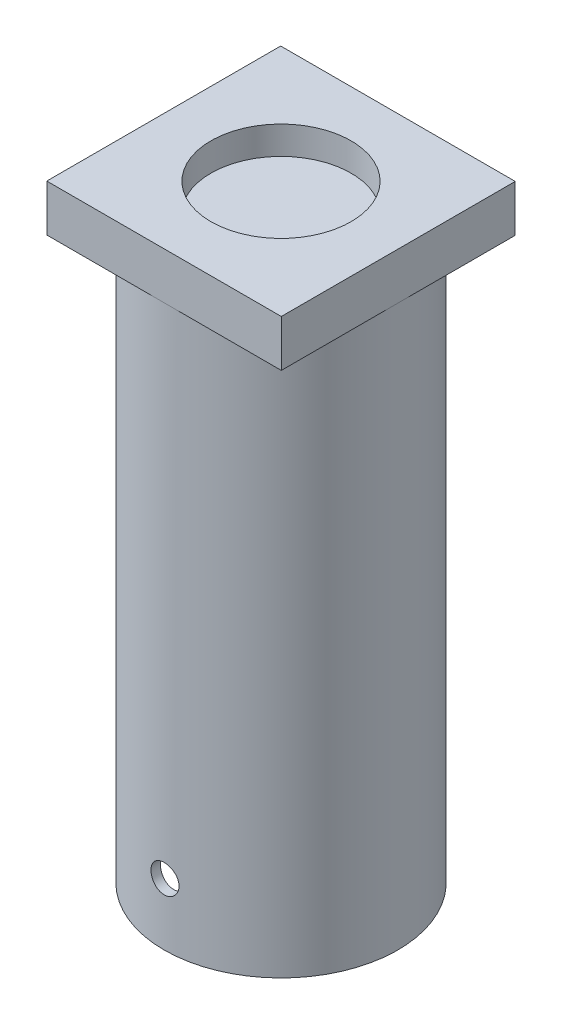
ISO-10303-21;
HEADER;
FILE_DESCRIPTION(('STEP AP214'),'2;1');
FILE_NAME('part.step','',(''),(''),'','','');
FILE_SCHEMA(('AUTOMOTIVE_DESIGN { 1 0 10303 214 1 1 1 1 }'));
ENDSEC;
DATA;
#1=APPLICATION_CONTEXT('core data for automotive mechanical design processes');
#2=APPLICATION_PROTOCOL_DEFINITION('international standard','automotive_design',2000,#1);
#3=PRODUCT_CONTEXT('',#1,'mechanical');
#4=PRODUCT('Part','Part','',(#3));
#5=PRODUCT_RELATED_PRODUCT_CATEGORY('part','',(#4));
#6=PRODUCT_DEFINITION_FORMATION('','',#4);
#7=PRODUCT_DEFINITION_CONTEXT('part definition',#1,'design');
#8=PRODUCT_DEFINITION('design','',#6,#7);
#9=PRODUCT_DEFINITION_SHAPE('','',#8);
#10=(LENGTH_UNIT() NAMED_UNIT(*) SI_UNIT(.MILLI.,.METRE.));
#11=(NAMED_UNIT(*) PLANE_ANGLE_UNIT() SI_UNIT($,.RADIAN.));
#12=(NAMED_UNIT(*) SI_UNIT($,.STERADIAN.) SOLID_ANGLE_UNIT());
#13=UNCERTAINTY_MEASURE_WITH_UNIT(LENGTH_MEASURE(1.E-05),#10,'distance_accuracy_value','');
#14=(GEOMETRIC_REPRESENTATION_CONTEXT(3) GLOBAL_UNCERTAINTY_ASSIGNED_CONTEXT((#13)) GLOBAL_UNIT_ASSIGNED_CONTEXT((#10,
#11,#12)) REPRESENTATION_CONTEXT('',''));
#15=CARTESIAN_POINT('',(0.,0.,0.));
#16=DIRECTION('',(0.,0.,1.));
#17=DIRECTION('',(1.,0.,0.));
#18=AXIS2_PLACEMENT_3D('',#15,#16,#17);
#19=CARTESIAN_POINT('',(0.,60.,0.));
#20=DIRECTION('',(0.,-1.,0.));
#21=DIRECTION('',(0.,0.,-1.));
#22=AXIS2_PLACEMENT_3D('',#19,#20,#21);
#23=CYLINDRICAL_SURFACE('',#22,12.5);
#24=CARTESIAN_POINT('',(0.,60.,0.));
#25=DIRECTION('',(0.,1.,0.));
#26=DIRECTION('',(0.,0.,1.));
#27=AXIS2_PLACEMENT_3D('',#24,#25,#26);
#28=CIRCLE('',#27,12.5);
#29=CARTESIAN_POINT('',(0.,60.,12.5));
#30=VERTEX_POINT('',#29);
#31=EDGE_CURVE('E11',#30,#30,#28,.T.);
#32=ORIENTED_EDGE('',*,*,#31,.F.);
#33=EDGE_LOOP('',(#32));
#34=FACE_BOUND('',#33,.T.);
#35=CARTESIAN_POINT('',(0.,0.,0.));
#36=DIRECTION('',(0.,1.,0.));
#37=DIRECTION('',(0.,0.,1.));
#38=AXIS2_PLACEMENT_3D('',#35,#36,#37);
#39=CIRCLE('',#38,12.5);
#40=CARTESIAN_POINT('',(0.,0.,12.5));
#41=VERTEX_POINT('',#40);
#42=EDGE_CURVE('E54',#41,#41,#39,.T.);
#43=ORIENTED_EDGE('',*,*,#42,.T.);
#44=EDGE_LOOP('',(#43));
#45=FACE_BOUND('',#44,.T.);
#46=CARTESIAN_POINT('',(-1.5,6.62,12.4096736459909));
#47=CARTESIAN_POINT('',(-1.49999641586388,6.70392957059518,12.4096748089167));
#48=CARTESIAN_POINT('',(-1.49293206748169,6.7879122600607,12.4105342894214));
#49=CARTESIAN_POINT('',(-1.46486159354819,6.95354230601578,12.4138782255216));
#50=CARTESIAN_POINT('',(-1.44384072619508,7.03518709784051,12.4163643992983));
#51=CARTESIAN_POINT('',(-1.38848417307918,7.19371920275691,12.4226761552619));
#52=CARTESIAN_POINT('',(-1.35415731394874,7.27060963056811,12.426500849368));
#53=CARTESIAN_POINT('',(-1.27318168778971,7.41752357105049,12.4350576249844));
#54=CARTESIAN_POINT('',(-1.22653510106007,7.48754829578398,12.4397895458966));
#55=CARTESIAN_POINT('',(-1.12198571965019,7.61911988580509,12.4496550027324));
#56=CARTESIAN_POINT('',(-1.06403198625323,7.6806261471743,12.4547902908254));
#57=CARTESIAN_POINT('',(-0.938622932174394,7.79306435908096,12.4648680792729));
#58=CARTESIAN_POINT('',(-0.871167147527067,7.8439957929709,12.4698105701984));
#59=CARTESIAN_POINT('',(-0.728414784233987,7.93398326646814,12.4789637011531));
#60=CARTESIAN_POINT('',(-0.653094976924493,7.97300270786982,12.4831720690333));
#61=CARTESIAN_POINT('',(-0.496912883636387,8.03782423019237,12.4903635621621));
#62=CARTESIAN_POINT('',(-0.41605078804277,8.06362676487387,12.4933467294733));
#63=CARTESIAN_POINT('',(-0.251493928492541,8.10116112805173,12.4977393662263));
#64=CARTESIAN_POINT('',(-0.167814735521689,8.11296032672289,12.4991563682204));
#65=CARTESIAN_POINT('',(0.000347248334283274,8.12236179965526,12.5002827183051));
#66=CARTESIAN_POINT('',(0.0848300098341703,8.11996459107911,12.4999921286017));
#67=CARTESIAN_POINT('',(0.251742833758765,8.10109543907432,12.4977421462633));
#68=CARTESIAN_POINT('',(0.334181218784107,8.08469594751381,12.4957913442169));
#69=CARTESIAN_POINT('',(0.495127185045589,8.038400924142,12.490449821119));
#70=CARTESIAN_POINT('',(0.573634696521302,8.00850515290918,12.4870590745233));
#71=CARTESIAN_POINT('',(0.724715561629688,7.93598863554674,12.4792038952277));
#72=CARTESIAN_POINT('',(0.797273648637692,7.89333638199679,12.4747368094346));
#73=CARTESIAN_POINT('',(0.934229460099392,7.79654055052193,12.465229048358));
#74=CARTESIAN_POINT('',(0.998626839383445,7.7423964867922,12.4601883488298));
#75=CARTESIAN_POINT('',(1.11785860561525,7.62374782522977,12.4500603372648));
#76=CARTESIAN_POINT('',(1.17263019439189,7.55918010931325,12.4449729316271));
#77=CARTESIAN_POINT('',(1.27056795912578,7.42173424316025,12.4353563023037));
#78=CARTESIAN_POINT('',(1.31373410365263,7.34885607041776,12.4308270801297));
#79=CARTESIAN_POINT('',(1.38723839179325,7.19680375492631,12.4228396027608));
#80=CARTESIAN_POINT('',(1.41757175578821,7.11762727937105,12.4193817467283));
#81=CARTESIAN_POINT('',(1.46449505016189,6.95525382024941,12.4139364153306));
#82=CARTESIAN_POINT('',(1.48108558929276,6.87205701494035,12.4119488748366));
#83=CARTESIAN_POINT('',(1.49996964356083,6.70455845181166,12.4096810007818));
#84=CARTESIAN_POINT('',(1.50235142135386,6.62026678205943,12.4093901280317));
#85=CARTESIAN_POINT('',(1.49298299027801,6.45248560957853,12.4105206650573));
#86=CARTESIAN_POINT('',(1.48123305845624,6.36899609115631,12.411942041265));
#87=CARTESIAN_POINT('',(1.44400895971009,6.20545210820101,12.4163273137489));
#88=CARTESIAN_POINT('',(1.41857731249469,6.12538782659534,12.4192864301079));
#89=CARTESIAN_POINT('',(1.35475538396312,5.97066035851202,12.4264098926624));
#90=CARTESIAN_POINT('',(1.31636468129306,5.89599734774848,12.4305742780457));
#91=CARTESIAN_POINT('',(1.22749651360805,5.75379185251269,12.4396643656649));
#92=CARTESIAN_POINT('',(1.17696103570738,5.68628585655935,12.4445936804928));
#93=CARTESIAN_POINT('',(1.06532008918354,5.56068244349411,12.4546467770184));
#94=CARTESIAN_POINT('',(1.0042142422181,5.50258536329706,12.4597705656719));
#95=CARTESIAN_POINT('',(0.872782136333861,5.39714012638254,12.4696675472455));
#96=CARTESIAN_POINT('',(0.802409249708917,5.34984987674429,12.4744387628015));
#97=CARTESIAN_POINT('',(0.65466821470529,5.26776089533545,12.483063621558));
#98=CARTESIAN_POINT('',(0.577300197822208,5.23296192881278,12.4869172820019));
#99=CARTESIAN_POINT('',(0.417959622359993,5.1769394975621,12.4932640215257));
#100=CARTESIAN_POINT('',(0.335999085323591,5.15568224005788,12.4957604851314));
#101=CARTESIAN_POINT('',(0.169640292495739,5.12723662820892,12.4991255682254));
#102=CARTESIAN_POINT('',(0.085242137730631,5.12004769165343,12.4999942550783));
#103=CARTESIAN_POINT('',(-0.0830300031278292,5.11995307794384,12.5000056524324));
#104=CARTESIAN_POINT('',(-0.166903952329435,5.12695798165839,12.4991591682624));
#105=CARTESIAN_POINT('',(-0.332273612398117,5.15486322745124,12.4958567701035));
#106=CARTESIAN_POINT('',(-0.413769324044743,5.17576356497476,12.4934008566421));
#107=CARTESIAN_POINT('',(-0.572059777991807,5.23083900756579,12.4871544009745));
#108=CARTESIAN_POINT('',(-0.648855904373999,5.26501018222725,12.4833642539575));
#109=CARTESIAN_POINT('',(-0.795637705262655,5.3456480347922,12.474869622158));
#110=CARTESIAN_POINT('',(-0.865623324646851,5.39211481220143,12.4701651299761));
#111=CARTESIAN_POINT('',(-0.997254742124291,5.49635684100313,12.4603319681132));
#112=CARTESIAN_POINT('',(-1.0588476339384,5.55419867766288,12.4552009088046));
#113=CARTESIAN_POINT('',(-1.17148865356204,5.67941151857622,12.4451123432295));
#114=CARTESIAN_POINT('',(-1.22253427406543,5.74678478225066,12.4401548784622));
#115=CARTESIAN_POINT('',(-1.31278537364373,5.88942146808525,12.4309559603764));
#116=CARTESIAN_POINT('',(-1.35194799100155,5.96471216413648,12.4267171228205));
#117=CARTESIAN_POINT('',(-1.41701902911872,6.12080887687539,12.419466118837));
#118=CARTESIAN_POINT('',(-1.44294198213015,6.20160873559888,12.4164526081981));
#119=CARTESIAN_POINT('',(-1.4745350503682,6.33902976955269,12.4127313618494));
#120=CARTESIAN_POINT('',(-1.48407082470974,6.39478137597994,12.4115903654975));
#121=CARTESIAN_POINT('',(-1.49680448454756,6.50701396606712,12.4100611186528));
#122=CARTESIAN_POINT('',(-1.50000241299709,6.5634949447813,12.4096728630583));
#123=CARTESIAN_POINT('',(-1.5,6.62,12.4096736459909));
#124=B_SPLINE_CURVE_WITH_KNOTS('',3,(#46,#47,#48,#49,#50,#51,#52,#53,#54,#55,#56,#57,#58,#59,
#60,#61,#62,#63,#64,#65,#66,#67,#68,#69,#70,#71,#72,#73,#74,#75,#76,#77,#78,#79,#80,#81,#82,#83,
#84,#85,#86,#87,#88,#89,#90,#91,#92,#93,#94,#95,#96,#97,#98,#99,#100,#101,#102,#103,#104,#105,
#106,#107,#108,#109,#110,#111,#112,#113,#114,#115,#116,#117,#118,#119,#120,#121,#122,#123),
.UNSPECIFIED.,.T.,.F.,(4,2,2,2,2,2,2,2,2,2,2,2,2,2,2,2,2,2,2,2,2,2,2,2,2,2,2,2,2,2,2,2,2,2,2,2,
2,2,4),(0.,0.251582306609609,0.503430774819312,0.755112462522263,1.0067496383611,
1.25954776660377,1.51235824273611,1.7659378087677,2.01950866836447,2.27185458608052,
2.52419131111312,2.77523023079344,3.02627360403335,3.27794222677635,3.52962149067918,
3.78288622204422,4.03615163930559,4.28951130338294,4.54285974404081,4.79463277043148,
5.0464008609825,5.29739099483104,5.54838929022027,5.80061125155309,6.05284224246468,
6.30639464647639,6.55994228515918,6.81285470170487,7.06575665136928,7.31707030939076,
7.56838388503437,7.81962308616498,8.07086432058376,8.32362252061905,8.57644073759112,
8.83016031080822,9.08360079205963,9.25297814464872,9.42235434931908),.UNSPECIFIED.);
#125=CARTESIAN_POINT('',(-1.5,6.62,12.4096736459909));
#126=VERTEX_POINT('',#125);
#127=EDGE_CURVE('E136',#126,#126,#124,.T.);
#128=ORIENTED_EDGE('',*,*,#127,.T.);
#129=EDGE_LOOP('',(#128));
#130=FACE_BOUND('',#129,.T.);
#131=ADVANCED_FACE('F39',(#34,#45,#130),#23,.T.);
#132=CARTESIAN_POINT('',(0.,60.,0.));
#133=DIRECTION('',(0.,-1.,0.));
#134=DIRECTION('',(0.,0.,-1.));
#135=AXIS2_PLACEMENT_3D('',#132,#133,#134);
#136=CYLINDRICAL_SURFACE('',#135,11.5);
#137=CARTESIAN_POINT('',(0.,0.,0.));
#138=DIRECTION('',(0.,1.,0.));
#139=DIRECTION('',(0.,0.,1.));
#140=AXIS2_PLACEMENT_3D('',#137,#138,#139);
#141=CIRCLE('',#140,11.5);
#142=CARTESIAN_POINT('',(0.,0.,11.5));
#143=VERTEX_POINT('',#142);
#144=EDGE_CURVE('E174',#143,#143,#141,.T.);
#145=ORIENTED_EDGE('',*,*,#144,.F.);
#146=EDGE_LOOP('',(#145));
#147=FACE_BOUND('',#146,.T.);
#148=CARTESIAN_POINT('',(0.,60.,0.));
#149=DIRECTION('',(0.,1.,0.));
#150=DIRECTION('',(0.,0.,1.));
#151=AXIS2_PLACEMENT_3D('',#148,#149,#150);
#152=CIRCLE('',#151,11.5);
#153=CARTESIAN_POINT('',(0.,60.,11.5));
#154=VERTEX_POINT('',#153);
#155=EDGE_CURVE('E135',#154,#154,#152,.T.);
#156=ORIENTED_EDGE('',*,*,#155,.T.);
#157=EDGE_LOOP('',(#156));
#158=FACE_BOUND('',#157,.T.);
#159=CARTESIAN_POINT('',(-1.5,6.62,11.4017542509914));
#160=CARTESIAN_POINT('',(-1.49999645301449,6.53612974605351,11.4017555010927));
#161=CARTESIAN_POINT('',(-1.49294203416221,6.45220782531927,11.4026896606142));
#162=CARTESIAN_POINT('',(-1.46491333453698,6.28670172381516,11.4063237260242));
#163=CARTESIAN_POINT('',(-1.44392470388228,6.2051200435448,11.4090254521656));
#164=CARTESIAN_POINT('',(-1.3886587589991,6.04671451862599,11.4158835494573));
#165=CARTESIAN_POINT('',(-1.3543907018073,5.96988740275981,11.4200389070908));
#166=CARTESIAN_POINT('',(-1.27355889313978,5.82308774393182,11.4293348464697));
#167=CARTESIAN_POINT('',(-1.22699716043964,5.75311407813169,11.4344752664174));
#168=CARTESIAN_POINT('',(-1.12259656958886,5.62156838698374,11.445197137233));
#169=CARTESIAN_POINT('',(-1.06469780379541,5.56004408459846,11.450780832969));
#170=CARTESIAN_POINT('',(-0.939395748791591,5.44755607833825,11.4617399588797));
#171=CARTESIAN_POINT('',(-0.871991977267099,5.39659291069305,11.4671153784682));
#172=CARTESIAN_POINT('',(-0.729292001348481,5.30650155148103,11.4770753814867));
#173=CARTESIAN_POINT('',(-0.653968201092621,5.26741671965129,11.4816570418954));
#174=CARTESIAN_POINT('',(-0.497756037054306,5.20246933335581,11.4894885821545));
#175=CARTESIAN_POINT('',(-0.41686789753894,5.17660624635005,11.4927385156426));
#176=CARTESIAN_POINT('',(-0.252312093764224,5.1389795606891,11.4975246059022));
#177=CARTESIAN_POINT('',(-0.168662889559622,5.12713647735637,11.4990704204953));
#178=CARTESIAN_POINT('',(-0.000551051593619637,5.11763955068957,11.5003071067839));
#179=CARTESIAN_POINT('',(0.0839115473356039,5.11998510242648,11.4999980575609));
#180=CARTESIAN_POINT('',(0.250711499958836,5.13873536177968,11.4975676318304));
#181=CARTESIAN_POINT('',(0.333058646852885,5.15505458012217,11.495457275758));
#182=CARTESIAN_POINT('',(0.493835455554849,5.2011551807269,11.4896737037343));
#183=CARTESIAN_POINT('',(0.572265037316047,5.23093683793923,11.4860004558634));
#184=CARTESIAN_POINT('',(0.723243851165393,5.30320714577404,11.4774848372199));
#185=CARTESIAN_POINT('',(0.795775273641202,5.34573258809549,11.4726390893116));
#186=CARTESIAN_POINT('',(0.932704606534634,5.44225654245437,11.4623201935655));
#187=CARTESIAN_POINT('',(0.997102110698518,5.49625562718919,11.4568470144162));
#188=CARTESIAN_POINT('',(1.11643819513605,5.61467233134334,11.4458372756446));
#189=CARTESIAN_POINT('',(1.17130282662102,5.6791644846265,11.4403005474487));
#190=CARTESIAN_POINT('',(1.2694404810369,5.8164811631493,11.4298278324284));
#191=CARTESIAN_POINT('',(1.31271346156177,5.88930571887019,11.4248918478017));
#192=CARTESIAN_POINT('',(1.38644483776161,6.04128812702736,11.4161795912173));
#193=CARTESIAN_POINT('',(1.41689697165318,6.12044905177646,11.4124038861902));
#194=CARTESIAN_POINT('',(1.46405488015557,6.28282134575287,11.4064505206358));
#195=CARTESIAN_POINT('',(1.48076137834162,6.36603250153029,11.4042727759921));
#196=CARTESIAN_POINT('',(1.49985514370483,6.53348911375159,11.4017774109739));
#197=CARTESIAN_POINT('',(1.50234663257981,6.61772249239381,11.4014462521966));
#198=CARTESIAN_POINT('',(1.49321496203163,6.78540547241167,11.4026457215703));
#199=CARTESIAN_POINT('',(1.48159213091645,6.86885509197255,11.4041763064158));
#200=CARTESIAN_POINT('',(1.44464963434861,7.03228727005644,11.4089144348313));
#201=CARTESIAN_POINT('',(1.41938072914779,7.11228149832657,11.4121157621508));
#202=CARTESIAN_POINT('',(1.35591573806608,7.26689781992073,11.4198296111094));
#203=CARTESIAN_POINT('',(1.31771916001082,7.34151970858118,11.4243421826685));
#204=CARTESIAN_POINT('',(1.22922802110626,7.48374376689709,11.4342023912125));
#205=CARTESIAN_POINT('',(1.17886529183312,7.5513031952319,11.4395546717524));
#206=CARTESIAN_POINT('',(1.06756750174708,7.67704780596861,11.4504767766229));
#207=CARTESIAN_POINT('',(1.00663199235394,7.73523259042251,11.4560466101759));
#208=CARTESIAN_POINT('',(0.875462338341591,7.84094402888092,11.4668179794224));
#209=CARTESIAN_POINT('',(0.805172669271243,7.88840207901289,11.4720170065382));
#210=CARTESIAN_POINT('',(0.657558967858981,7.97083753540957,11.4814231748458));
#211=CARTESIAN_POINT('',(0.580235088015153,8.00581521216149,11.4856303375335));
#212=CARTESIAN_POINT('',(0.420973071168351,8.06218448448026,11.4925676402684));
#213=CARTESIAN_POINT('',(0.339049006517432,8.08361529312715,11.4953020399787));
#214=CARTESIAN_POINT('',(0.172727196515984,8.11240992971607,11.4990034533124));
#215=CARTESIAN_POINT('',(0.0883295733447041,8.119774451265,11.4999705540811));
#216=CARTESIAN_POINT('',(-0.0798746769516796,8.12021369871507,11.5000279000696));
#217=CARTESIAN_POINT('',(-0.163681043071284,8.11339404014946,11.4991320170928));
#218=CARTESIAN_POINT('',(-0.328945491538641,8.08588274606021,11.4955917059201));
#219=CARTESIAN_POINT('',(-0.41040357656716,8.06519112637328,11.4929472797203));
#220=CARTESIAN_POINT('',(-0.568642219855317,8.01055733378628,11.4862056490748));
#221=CARTESIAN_POINT('',(-0.645424712431708,7.97662068407239,11.4821090502512));
#222=CARTESIAN_POINT('',(-0.792221787328596,7.89647113767378,11.4729159452671));
#223=CARTESIAN_POINT('',(-0.862236260369662,7.85025804281329,11.4678194229654));
#224=CARTESIAN_POINT('',(-0.994048728546038,7.74647834381003,11.4571496362498));
#225=CARTESIAN_POINT('',(-1.05578467493496,7.6888332476528,11.4515732358814));
#226=CARTESIAN_POINT('',(-1.16874758745896,7.56398969875131,11.4405969587125));
#227=CARTESIAN_POINT('',(-1.2199720669361,7.49678899182308,11.4351971239349));
#228=CARTESIAN_POINT('',(-1.31064441090517,7.35441564651668,11.425161148306));
#229=CARTESIAN_POINT('',(-1.35004186374931,7.27921068337355,11.4205283132887));
#230=CARTESIAN_POINT('',(-1.41559127347487,7.12323216464592,11.4125895944072));
#231=CARTESIAN_POINT('',(-1.44175750369104,7.04246471702342,11.4092822814234));
#232=CARTESIAN_POINT('',(-1.47390259785781,6.90440820135864,11.4051643222105));
#233=CARTESIAN_POINT('',(-1.48367487173576,6.84798658642477,11.4038919959272));
#234=CARTESIAN_POINT('',(-1.49672475464482,6.73438465517099,11.4021865375875));
#235=CARTESIAN_POINT('',(-1.50000241924847,6.67720434534723,11.4017533983503));
#236=CARTESIAN_POINT('',(-1.5,6.62,11.4017542509914));
#237=B_SPLINE_CURVE_WITH_KNOTS('',3,(#159,#160,#161,#162,#163,#164,#165,#166,#167,#168,#169,
#170,#171,#172,#173,#174,#175,#176,#177,#178,#179,#180,#181,#182,#183,#184,#185,#186,#187,#188,
#189,#190,#191,#192,#193,#194,#195,#196,#197,#198,#199,#200,#201,#202,#203,#204,#205,#206,#207,
#208,#209,#210,#211,#212,#213,#214,#215,#216,#217,#218,#219,#220,#221,#222,#223,#224,#225,#226,
#227,#228,#229,#230,#231,#232,#233,#234,#235,#236),.UNSPECIFIED.,.T.,.F.,(4,2,2,2,2,2,2,2,2,2,2,
2,2,2,2,2,2,2,2,2,2,2,2,2,2,2,2,2,2,2,2,2,2,2,2,2,2,2,4),(0.,0.251401763409771,
0.503062830563612,0.754548780434044,1.00599345881713,1.25880454908432,1.51162847240694,
1.76536449581033,2.01909029853277,2.27137063822619,2.52364022208436,2.77437738752206,
3.0251196741212,3.27659295200133,3.52807878491241,3.78143590806991,4.03479395807764,
4.28827560662902,4.54174391096107,4.79335142269097,5.04495308198347,5.29562522352575,
5.54630690957677,5.79842717499934,6.05055813995758,6.30425867142356,6.55795370410217,
6.8109109813241,7.06385578493151,7.31492390374275,7.56599173592654,7.81695498432957,
8.06792228421936,8.32067641903952,8.57349027819168,8.82736691371986,9.08096908946926,
9.25244104378408,9.42391153085533),.UNSPECIFIED.);
#238=CARTESIAN_POINT('',(-1.5,6.62,11.4017542509914));
#239=VERTEX_POINT('',#238);
#240=EDGE_CURVE('E42',#239,#239,#237,.T.);
#241=ORIENTED_EDGE('',*,*,#240,.T.);
#242=EDGE_LOOP('',(#241));
#243=FACE_BOUND('',#242,.T.);
#244=ADVANCED_FACE('F149',(#147,#158,#243),#136,.F.);
#245=CARTESIAN_POINT('',(0.,0.,0.));
#246=DIRECTION('',(0.,1.,0.));
#247=DIRECTION('',(0.,0.,1.));
#248=AXIS2_PLACEMENT_3D('',#245,#246,#247);
#249=PLANE('',#248);
#250=ORIENTED_EDGE('',*,*,#42,.F.);
#251=EDGE_LOOP('',(#250));
#252=FACE_BOUND('',#251,.T.);
#253=ORIENTED_EDGE('',*,*,#144,.T.);
#254=EDGE_LOOP('',(#253));
#255=FACE_BOUND('',#254,.T.);
#256=ADVANCED_FACE('F152',(#252,#255),#249,.F.);
#257=CARTESIAN_POINT('',(0.,6.62,12.501));
#258=DIRECTION('',(0.,0.,-1.));
#259=DIRECTION('',(-1.,0.,0.));
#260=AXIS2_PLACEMENT_3D('',#257,#258,#259);
#261=CYLINDRICAL_SURFACE('',#260,1.5);
#262=ORIENTED_EDGE('',*,*,#240,.F.);
#263=EDGE_LOOP('',(#262));
#264=FACE_BOUND('',#263,.T.);
#265=ORIENTED_EDGE('',*,*,#127,.F.);
#266=EDGE_LOOP('',(#265));
#267=FACE_BOUND('',#266,.T.);
#268=ADVANCED_FACE('F145',(#264,#267),#261,.F.);
#269=CARTESIAN_POINT('',(0.,60.,0.));
#270=DIRECTION('',(0.,1.,0.));
#271=DIRECTION('',(0.,0.,1.));
#272=AXIS2_PLACEMENT_3D('',#269,#270,#271);
#273=PLANE('',#272);
#274=ORIENTED_EDGE('',*,*,#155,.F.);
#275=EDGE_LOOP('',(#274));
#276=FACE_BOUND('',#275,.T.);
#277=ADVANCED_FACE('F159',(#276),#273,.F.);
#278=CARTESIAN_POINT('',(12.548712851795,65.,-12.5154478057969));
#279=DIRECTION('',(-1.,0.,0.));
#280=DIRECTION('',(0.,0.,1.));
#281=AXIS2_PLACEMENT_3D('',#278,#279,#280);
#282=PLANE('',#281);
#283=DIRECTION('',(0.,0.,-1.));
#284=VECTOR('',#283,1.);
#285=CARTESIAN_POINT('',(12.548712851795,60.,-12.5154478057969));
#286=LINE('',#285,#284);
#287=CARTESIAN_POINT('',(12.548712851795,60.,12.5154478057969));
#288=VERTEX_POINT('',#287);
#289=CARTESIAN_POINT('',(12.548712851795,60.,-12.5154478057969));
#290=VERTEX_POINT('',#289);
#291=EDGE_CURVE('E118',#288,#290,#286,.T.);
#292=ORIENTED_EDGE('',*,*,#291,.T.);
#293=DIRECTION('',(0.,-1.,0.));
#294=VECTOR('',#293,1.);
#295=CARTESIAN_POINT('',(12.548712851795,65.,-12.5154478057969));
#296=LINE('',#295,#294);
#297=CARTESIAN_POINT('',(12.548712851795,65.,-12.5154478057969));
#298=VERTEX_POINT('',#297);
#299=EDGE_CURVE('E107',#298,#290,#296,.T.);
#300=ORIENTED_EDGE('',*,*,#299,.F.);
#301=DIRECTION('',(0.,0.,-1.));
#302=VECTOR('',#301,1.);
#303=CARTESIAN_POINT('',(12.548712851795,65.,-12.5154478057969));
#304=LINE('',#303,#302);
#305=CARTESIAN_POINT('',(12.548712851795,65.,12.5154478057969));
#306=VERTEX_POINT('',#305);
#307=EDGE_CURVE('E99',#306,#298,#304,.T.);
#308=ORIENTED_EDGE('',*,*,#307,.F.);
#309=DIRECTION('',(0.,-1.,0.));
#310=VECTOR('',#309,1.);
#311=CARTESIAN_POINT('',(12.548712851795,65.,12.5154478057969));
#312=LINE('',#311,#310);
#313=EDGE_CURVE('E114',#306,#288,#312,.T.);
#314=ORIENTED_EDGE('',*,*,#313,.T.);
#315=EDGE_LOOP('',(#292,#300,#308,#314));
#316=FACE_BOUND('',#315,.T.);
#317=ADVANCED_FACE('F188',(#316),#282,.F.);
#318=CARTESIAN_POINT('',(-12.548712851795,65.,-12.5154478057969));
#319=DIRECTION('',(0.,0.,1.));
#320=DIRECTION('',(1.,0.,0.));
#321=AXIS2_PLACEMENT_3D('',#318,#319,#320);
#322=PLANE('',#321);
#323=DIRECTION('',(-1.,0.,0.));
#324=VECTOR('',#323,1.);
#325=CARTESIAN_POINT('',(-12.548712851795,60.,-12.5154478057969));
#326=LINE('',#325,#324);
#327=CARTESIAN_POINT('',(-12.548712851795,60.,-12.5154478057969));
#328=VERTEX_POINT('',#327);
#329=EDGE_CURVE('E105',#290,#328,#326,.T.);
#330=ORIENTED_EDGE('',*,*,#329,.T.);
#331=DIRECTION('',(0.,-1.,0.));
#332=VECTOR('',#331,1.);
#333=CARTESIAN_POINT('',(-12.548712851795,65.,-12.5154478057969));
#334=LINE('',#333,#332);
#335=CARTESIAN_POINT('',(-12.548712851795,65.,-12.5154478057969));
#336=VERTEX_POINT('',#335);
#337=EDGE_CURVE('E103',#336,#328,#334,.T.);
#338=ORIENTED_EDGE('',*,*,#337,.F.);
#339=DIRECTION('',(-1.,0.,0.));
#340=VECTOR('',#339,1.);
#341=CARTESIAN_POINT('',(-12.548712851795,65.,-12.5154478057969));
#342=LINE('',#341,#340);
#343=EDGE_CURVE('E94',#298,#336,#342,.T.);
#344=ORIENTED_EDGE('',*,*,#343,.F.);
#345=ORIENTED_EDGE('',*,*,#299,.T.);
#346=EDGE_LOOP('',(#330,#338,#344,#345));
#347=FACE_BOUND('',#346,.T.);
#348=ADVANCED_FACE('F104',(#347),#322,.F.);
#349=CARTESIAN_POINT('',(-12.548712851795,65.,-12.5154478057969));
#350=DIRECTION('',(1.,0.,0.));
#351=DIRECTION('',(0.,0.,-1.));
#352=AXIS2_PLACEMENT_3D('',#349,#350,#351);
#353=PLANE('',#352);
#354=DIRECTION('',(0.,0.,1.));
#355=VECTOR('',#354,1.);
#356=CARTESIAN_POINT('',(-12.548712851795,60.,-12.5154478057969));
#357=LINE('',#356,#355);
#358=CARTESIAN_POINT('',(-12.548712851795,60.,12.5154478057969));
#359=VERTEX_POINT('',#358);
#360=EDGE_CURVE('E80',#328,#359,#357,.T.);
#361=ORIENTED_EDGE('',*,*,#360,.T.);
#362=DIRECTION('',(0.,-1.,0.));
#363=VECTOR('',#362,1.);
#364=CARTESIAN_POINT('',(-12.548712851795,65.,12.5154478057969));
#365=LINE('',#364,#363);
#366=CARTESIAN_POINT('',(-12.548712851795,65.,12.5154478057969));
#367=VERTEX_POINT('',#366);
#368=EDGE_CURVE('E108',#367,#359,#365,.T.);
#369=ORIENTED_EDGE('',*,*,#368,.F.);
#370=DIRECTION('',(0.,0.,1.));
#371=VECTOR('',#370,1.);
#372=CARTESIAN_POINT('',(-12.548712851795,65.,-12.5154478057969));
#373=LINE('',#372,#371);
#374=EDGE_CURVE('E97',#336,#367,#373,.T.);
#375=ORIENTED_EDGE('',*,*,#374,.F.);
#376=ORIENTED_EDGE('',*,*,#337,.T.);
#377=EDGE_LOOP('',(#361,#369,#375,#376));
#378=FACE_BOUND('',#377,.T.);
#379=ADVANCED_FACE('F110',(#378),#353,.F.);
#380=CARTESIAN_POINT('',(-12.548712851795,65.,12.5154478057969));
#381=DIRECTION('',(0.,0.,-1.));
#382=DIRECTION('',(-1.,0.,0.));
#383=AXIS2_PLACEMENT_3D('',#380,#381,#382);
#384=PLANE('',#383);
#385=DIRECTION('',(1.,0.,0.));
#386=VECTOR('',#385,1.);
#387=CARTESIAN_POINT('',(-12.548712851795,60.,12.5154478057969));
#388=LINE('',#387,#386);
#389=EDGE_CURVE('E86',#359,#288,#388,.T.);
#390=ORIENTED_EDGE('',*,*,#389,.T.);
#391=ORIENTED_EDGE('',*,*,#313,.F.);
#392=DIRECTION('',(1.,0.,0.));
#393=VECTOR('',#392,1.);
#394=CARTESIAN_POINT('',(-12.548712851795,65.,12.5154478057969));
#395=LINE('',#394,#393);
#396=EDGE_CURVE('E63',#367,#306,#395,.T.);
#397=ORIENTED_EDGE('',*,*,#396,.F.);
#398=ORIENTED_EDGE('',*,*,#368,.T.);
#399=EDGE_LOOP('',(#390,#391,#397,#398));
#400=FACE_BOUND('',#399,.T.);
#401=ADVANCED_FACE('F207',(#400),#384,.F.);
#402=CARTESIAN_POINT('',(0.,65.,0.));
#403=DIRECTION('',(0.,1.,0.));
#404=DIRECTION('',(0.,0.,1.));
#405=AXIS2_PLACEMENT_3D('',#402,#403,#404);
#406=PLANE('',#405);
#407=CARTESIAN_POINT('',(0.,65.,0.));
#408=DIRECTION('',(0.,1.,0.));
#409=DIRECTION('',(0.,0.,1.));
#410=AXIS2_PLACEMENT_3D('',#407,#408,#409);
#411=CIRCLE('',#410,7.5);
#412=CARTESIAN_POINT('',(0.,65.,7.5));
#413=VERTEX_POINT('',#412);
#414=EDGE_CURVE('E262',#413,#413,#411,.T.);
#415=ORIENTED_EDGE('',*,*,#414,.F.);
#416=EDGE_LOOP('',(#415));
#417=FACE_BOUND('',#416,.T.);
#418=ORIENTED_EDGE('',*,*,#307,.T.);
#419=ORIENTED_EDGE('',*,*,#343,.T.);
#420=ORIENTED_EDGE('',*,*,#374,.T.);
#421=ORIENTED_EDGE('',*,*,#396,.T.);
#422=EDGE_LOOP('',(#418,#419,#420,#421));
#423=FACE_BOUND('',#422,.T.);
#424=ADVANCED_FACE('F95',(#417,#423),#406,.T.);
#425=ORIENTED_EDGE('',*,*,#31,.T.);
#426=EDGE_LOOP('',(#425));
#427=FACE_BOUND('',#426,.T.);
#428=ORIENTED_EDGE('',*,*,#291,.F.);
#429=ORIENTED_EDGE('',*,*,#389,.F.);
#430=ORIENTED_EDGE('',*,*,#360,.F.);
#431=ORIENTED_EDGE('',*,*,#329,.F.);
#432=EDGE_LOOP('',(#428,#429,#430,#431));
#433=FACE_BOUND('',#432,.T.);
#434=ADVANCED_FACE('F190',(#427,#433),#273,.F.);
#435=CARTESIAN_POINT('',(0.,62.,0.));
#436=DIRECTION('',(0.,1.,0.));
#437=DIRECTION('',(0.,0.,1.));
#438=AXIS2_PLACEMENT_3D('',#435,#436,#437);
#439=CYLINDRICAL_SURFACE('',#438,7.5);
#440=CARTESIAN_POINT('',(0.,62.,0.));
#441=DIRECTION('',(0.,1.,0.));
#442=DIRECTION('',(0.,0.,1.));
#443=AXIS2_PLACEMENT_3D('',#440,#441,#442);
#444=CIRCLE('',#443,7.5);
#445=CARTESIAN_POINT('',(0.,62.,7.5));
#446=VERTEX_POINT('',#445);
#447=EDGE_CURVE('E122',#446,#446,#444,.T.);
#448=ORIENTED_EDGE('',*,*,#447,.F.);
#449=EDGE_LOOP('',(#448));
#450=FACE_BOUND('',#449,.T.);
#451=ORIENTED_EDGE('',*,*,#414,.T.);
#452=EDGE_LOOP('',(#451));
#453=FACE_BOUND('',#452,.T.);
#454=ADVANCED_FACE('F198',(#450,#453),#439,.F.);
#455=CARTESIAN_POINT('',(0.,62.,0.));
#456=DIRECTION('',(0.,1.,0.));
#457=DIRECTION('',(0.,0.,1.));
#458=AXIS2_PLACEMENT_3D('',#455,#456,#457);
#459=PLANE('',#458);
#460=ORIENTED_EDGE('',*,*,#447,.T.);
#461=EDGE_LOOP('',(#460));
#462=FACE_BOUND('',#461,.T.);
#463=ADVANCED_FACE('F204',(#462),#459,.T.);
#464=CLOSED_SHELL('',(#131,#244,#256,#268,#277,#317,#348,#379,#401,#424,#434,#454,#463));
#465=MANIFOLD_SOLID_BREP('B2',#464);
#466=ADVANCED_BREP_SHAPE_REPRESENTATION('',(#18,#465),#14);
#467=SHAPE_DEFINITION_REPRESENTATION(#9,#466);
ENDSEC;
END-ISO-10303-21;
